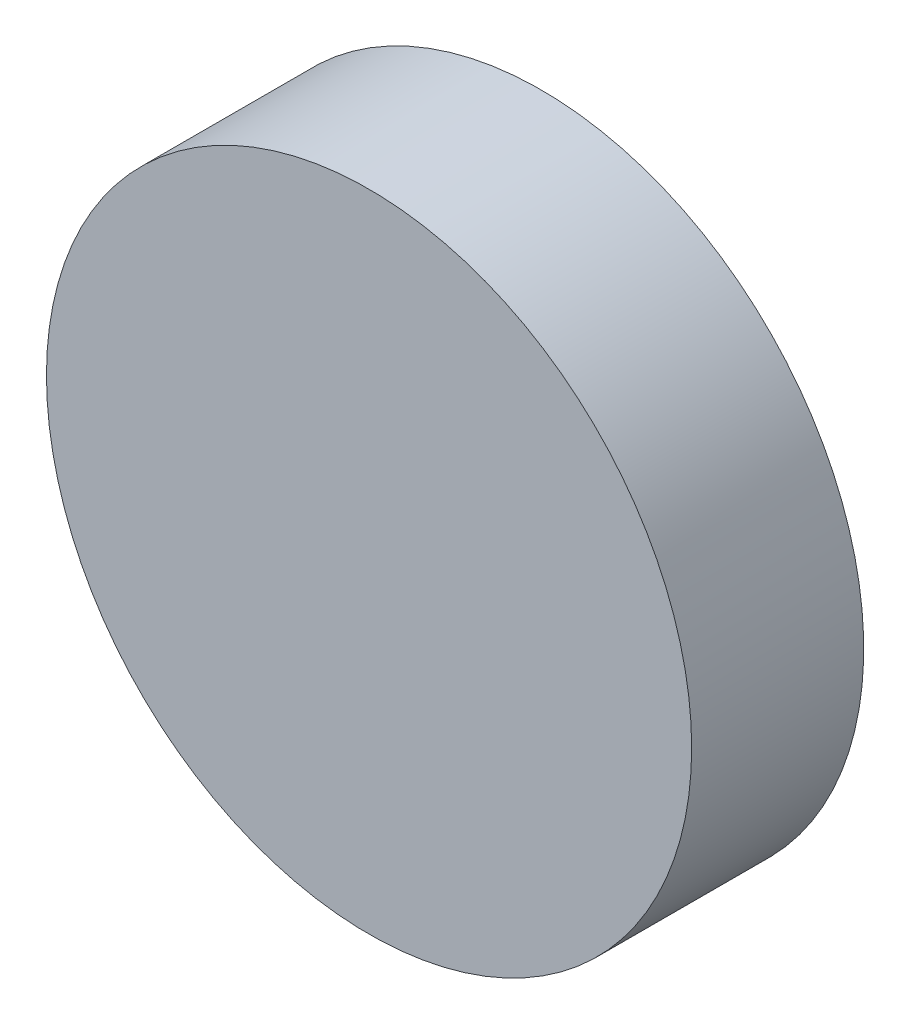
ISO-10303-21;
HEADER;
FILE_DESCRIPTION(('STEP AP214'),'2;1');
FILE_NAME('part.step','',(''),(''),'','','');
FILE_SCHEMA(('AUTOMOTIVE_DESIGN { 1 0 10303 214 1 1 1 1 }'));
ENDSEC;
DATA;
#1=APPLICATION_CONTEXT('core data for automotive mechanical design processes');
#2=APPLICATION_PROTOCOL_DEFINITION('international standard','automotive_design',2000,#1);
#3=PRODUCT_CONTEXT('',#1,'mechanical');
#4=PRODUCT('Part','Part','',(#3));
#5=PRODUCT_RELATED_PRODUCT_CATEGORY('part','',(#4));
#6=PRODUCT_DEFINITION_FORMATION('','',#4);
#7=PRODUCT_DEFINITION_CONTEXT('part definition',#1,'design');
#8=PRODUCT_DEFINITION('design','',#6,#7);
#9=PRODUCT_DEFINITION_SHAPE('','',#8);
#10=(LENGTH_UNIT() NAMED_UNIT(*) SI_UNIT(.MILLI.,.METRE.));
#11=(NAMED_UNIT(*) PLANE_ANGLE_UNIT() SI_UNIT($,.RADIAN.));
#12=(NAMED_UNIT(*) SI_UNIT($,.STERADIAN.) SOLID_ANGLE_UNIT());
#13=UNCERTAINTY_MEASURE_WITH_UNIT(LENGTH_MEASURE(1.E-05),#10,'distance_accuracy_value','');
#14=(GEOMETRIC_REPRESENTATION_CONTEXT(3) GLOBAL_UNCERTAINTY_ASSIGNED_CONTEXT((#13)) GLOBAL_UNIT_ASSIGNED_CONTEXT((#10,
#11,#12)) REPRESENTATION_CONTEXT('',''));
#15=CARTESIAN_POINT('',(0.,0.,0.));
#16=DIRECTION('',(0.,0.,1.));
#17=DIRECTION('',(1.,0.,0.));
#18=AXIS2_PLACEMENT_3D('',#15,#16,#17);
#19=CARTESIAN_POINT('',(0.,0.,6.));
#20=DIRECTION('',(0.,0.,-1.));
#21=DIRECTION('',(-1.,0.,0.));
#22=AXIS2_PLACEMENT_3D('',#19,#20,#21);
#23=CYLINDRICAL_SURFACE('',#22,7.5);
#24=CARTESIAN_POINT('',(0.,0.,6.));
#25=DIRECTION('',(0.,0.,1.));
#26=DIRECTION('',(1.,0.,0.));
#27=AXIS2_PLACEMENT_3D('',#24,#25,#26);
#28=CIRCLE('',#27,7.5);
#29=CARTESIAN_POINT('',(7.5,0.,6.));
#30=VERTEX_POINT('',#29);
#31=EDGE_CURVE('E10',#30,#30,#28,.T.);
#32=ORIENTED_EDGE('',*,*,#31,.F.);
#33=EDGE_LOOP('',(#32));
#34=FACE_BOUND('',#33,.T.);
#35=CARTESIAN_POINT('',(0.,0.,2.));
#36=DIRECTION('',(0.,0.,-1.));
#37=DIRECTION('',(-1.,0.,0.));
#38=AXIS2_PLACEMENT_3D('',#35,#36,#37);
#39=CIRCLE('',#38,7.5);
#40=CARTESIAN_POINT('',(-7.5,0.,2.));
#41=VERTEX_POINT('',#40);
#42=EDGE_CURVE('E37',#41,#41,#39,.T.);
#43=ORIENTED_EDGE('',*,*,#42,.F.);
#44=EDGE_LOOP('',(#43));
#45=FACE_BOUND('',#44,.T.);
#46=ADVANCED_FACE('F31',(#34,#45),#23,.T.);
#47=CARTESIAN_POINT('',(0.,0.,6.));
#48=DIRECTION('',(0.,0.,1.));
#49=DIRECTION('',(1.,0.,0.));
#50=AXIS2_PLACEMENT_3D('',#47,#48,#49);
#51=PLANE('',#50);
#52=ORIENTED_EDGE('',*,*,#31,.T.);
#53=EDGE_LOOP('',(#52));
#54=FACE_BOUND('',#53,.T.);
#55=ADVANCED_FACE('F46',(#54),#51,.T.);
#56=CARTESIAN_POINT('',(0.,0.,2.));
#57=DIRECTION('',(0.,0.,-1.));
#58=DIRECTION('',(-1.,0.,0.));
#59=AXIS2_PLACEMENT_3D('',#56,#57,#58);
#60=PLANE('',#59);
#61=ORIENTED_EDGE('',*,*,#42,.T.);
#62=EDGE_LOOP('',(#61));
#63=FACE_BOUND('',#62,.T.);
#64=ADVANCED_FACE('F43',(#63),#60,.T.);
#65=CLOSED_SHELL('',(#46,#55,#64));
#66=MANIFOLD_SOLID_BREP('B2',#65);
#67=ADVANCED_BREP_SHAPE_REPRESENTATION('',(#18,#66),#14);
#68=SHAPE_DEFINITION_REPRESENTATION(#9,#67);
ENDSEC;
END-ISO-10303-21;
